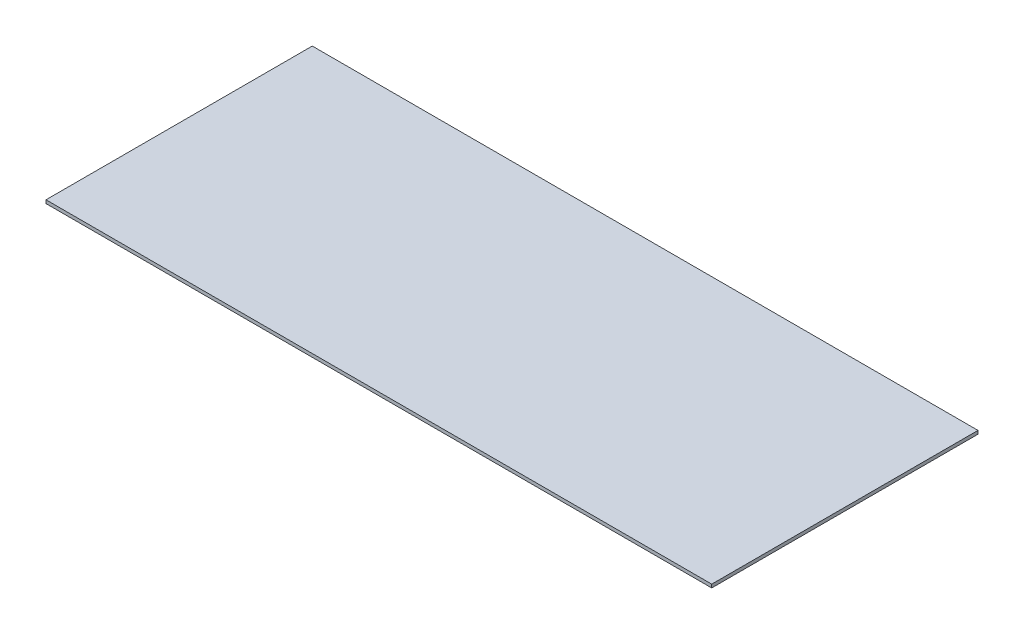
ISO-10303-21;
HEADER;
FILE_DESCRIPTION(('STEP AP214'),'2;1');
FILE_NAME('part.step','',(''),(''),'','','');
FILE_SCHEMA(('AUTOMOTIVE_DESIGN { 1 0 10303 214 1 1 1 1 }'));
ENDSEC;
DATA;
#1=APPLICATION_CONTEXT('core data for automotive mechanical design processes');
#2=APPLICATION_PROTOCOL_DEFINITION('international standard','automotive_design',2000,#1);
#3=PRODUCT_CONTEXT('',#1,'mechanical');
#4=PRODUCT('Part','Part','',(#3));
#5=PRODUCT_RELATED_PRODUCT_CATEGORY('part','',(#4));
#6=PRODUCT_DEFINITION_FORMATION('','',#4);
#7=PRODUCT_DEFINITION_CONTEXT('part definition',#1,'design');
#8=PRODUCT_DEFINITION('design','',#6,#7);
#9=PRODUCT_DEFINITION_SHAPE('','',#8);
#10=(LENGTH_UNIT() NAMED_UNIT(*) SI_UNIT(.MILLI.,.METRE.));
#11=(NAMED_UNIT(*) PLANE_ANGLE_UNIT() SI_UNIT($,.RADIAN.));
#12=(NAMED_UNIT(*) SI_UNIT($,.STERADIAN.) SOLID_ANGLE_UNIT());
#13=UNCERTAINTY_MEASURE_WITH_UNIT(LENGTH_MEASURE(1.E-05),#10,'distance_accuracy_value','');
#14=(GEOMETRIC_REPRESENTATION_CONTEXT(3) GLOBAL_UNCERTAINTY_ASSIGNED_CONTEXT((#13)) GLOBAL_UNIT_ASSIGNED_CONTEXT((#10,
#11,#12)) REPRESENTATION_CONTEXT('',''));
#15=CARTESIAN_POINT('',(0.,0.,0.));
#16=DIRECTION('',(0.,0.,1.));
#17=DIRECTION('',(1.,0.,0.));
#18=AXIS2_PLACEMENT_3D('',#15,#16,#17);
#19=CARTESIAN_POINT('',(-100.,1.,-40.));
#20=DIRECTION('',(1.,0.,0.));
#21=DIRECTION('',(0.,0.,-1.));
#22=AXIS2_PLACEMENT_3D('',#19,#20,#21);
#23=PLANE('',#22);
#24=DIRECTION('',(0.,0.,1.));
#25=VECTOR('',#24,1.);
#26=CARTESIAN_POINT('',(-100.,0.,-40.));
#27=LINE('',#26,#25);
#28=CARTESIAN_POINT('',(-100.,0.,-40.));
#29=VERTEX_POINT('',#28);
#30=CARTESIAN_POINT('',(-100.,0.,40.));
#31=VERTEX_POINT('',#30);
#32=EDGE_CURVE('E97',#29,#31,#27,.T.);
#33=ORIENTED_EDGE('',*,*,#32,.T.);
#34=DIRECTION('',(0.,-1.,0.));
#35=VECTOR('',#34,1.);
#36=CARTESIAN_POINT('',(-100.,1.,40.));
#37=LINE('',#36,#35);
#38=CARTESIAN_POINT('',(-100.,1.,40.));
#39=VERTEX_POINT('',#38);
#40=EDGE_CURVE('E11',#39,#31,#37,.T.);
#41=ORIENTED_EDGE('',*,*,#40,.F.);
#42=DIRECTION('',(0.,0.,1.));
#43=VECTOR('',#42,1.);
#44=CARTESIAN_POINT('',(-100.,1.,-40.));
#45=LINE('',#44,#43);
#46=CARTESIAN_POINT('',(-100.,1.,-40.));
#47=VERTEX_POINT('',#46);
#48=EDGE_CURVE('E85',#47,#39,#45,.T.);
#49=ORIENTED_EDGE('',*,*,#48,.F.);
#50=DIRECTION('',(0.,-1.,0.));
#51=VECTOR('',#50,1.);
#52=CARTESIAN_POINT('',(-100.,1.,-40.));
#53=LINE('',#52,#51);
#54=EDGE_CURVE('E93',#47,#29,#53,.T.);
#55=ORIENTED_EDGE('',*,*,#54,.T.);
#56=EDGE_LOOP('',(#33,#41,#49,#55));
#57=FACE_BOUND('',#56,.T.);
#58=ADVANCED_FACE('F34',(#57),#23,.F.);
#59=CARTESIAN_POINT('',(-100.,1.,40.));
#60=DIRECTION('',(0.,0.,-1.));
#61=DIRECTION('',(-1.,0.,0.));
#62=AXIS2_PLACEMENT_3D('',#59,#60,#61);
#63=PLANE('',#62);
#64=DIRECTION('',(1.,0.,0.));
#65=VECTOR('',#64,1.);
#66=CARTESIAN_POINT('',(-100.,0.,40.));
#67=LINE('',#66,#65);
#68=CARTESIAN_POINT('',(100.,0.,40.));
#69=VERTEX_POINT('',#68);
#70=EDGE_CURVE('E89',#31,#69,#67,.T.);
#71=ORIENTED_EDGE('',*,*,#70,.T.);
#72=DIRECTION('',(0.,-1.,0.));
#73=VECTOR('',#72,1.);
#74=CARTESIAN_POINT('',(100.,1.,40.));
#75=LINE('',#74,#73);
#76=CARTESIAN_POINT('',(100.,1.,40.));
#77=VERTEX_POINT('',#76);
#78=EDGE_CURVE('E42',#77,#69,#75,.T.);
#79=ORIENTED_EDGE('',*,*,#78,.F.);
#80=DIRECTION('',(1.,0.,0.));
#81=VECTOR('',#80,1.);
#82=CARTESIAN_POINT('',(-100.,1.,40.));
#83=LINE('',#82,#81);
#84=EDGE_CURVE('E80',#39,#77,#83,.T.);
#85=ORIENTED_EDGE('',*,*,#84,.F.);
#86=ORIENTED_EDGE('',*,*,#40,.T.);
#87=EDGE_LOOP('',(#71,#79,#85,#86));
#88=FACE_BOUND('',#87,.T.);
#89=ADVANCED_FACE('F88',(#88),#63,.F.);
#90=CARTESIAN_POINT('',(100.,1.,-40.));
#91=DIRECTION('',(-1.,0.,0.));
#92=DIRECTION('',(0.,0.,1.));
#93=AXIS2_PLACEMENT_3D('',#90,#91,#92);
#94=PLANE('',#93);
#95=DIRECTION('',(0.,0.,-1.));
#96=VECTOR('',#95,1.);
#97=CARTESIAN_POINT('',(100.,0.,-40.));
#98=LINE('',#97,#96);
#99=CARTESIAN_POINT('',(100.,0.,-40.));
#100=VERTEX_POINT('',#99);
#101=EDGE_CURVE('E67',#69,#100,#98,.T.);
#102=ORIENTED_EDGE('',*,*,#101,.T.);
#103=DIRECTION('',(0.,-1.,0.));
#104=VECTOR('',#103,1.);
#105=CARTESIAN_POINT('',(100.,1.,-40.));
#106=LINE('',#105,#104);
#107=CARTESIAN_POINT('',(100.,1.,-40.));
#108=VERTEX_POINT('',#107);
#109=EDGE_CURVE('E90',#108,#100,#106,.T.);
#110=ORIENTED_EDGE('',*,*,#109,.F.);
#111=DIRECTION('',(0.,0.,-1.));
#112=VECTOR('',#111,1.);
#113=CARTESIAN_POINT('',(100.,1.,-40.));
#114=LINE('',#113,#112);
#115=EDGE_CURVE('E83',#77,#108,#114,.T.);
#116=ORIENTED_EDGE('',*,*,#115,.F.);
#117=ORIENTED_EDGE('',*,*,#78,.T.);
#118=EDGE_LOOP('',(#102,#110,#116,#117));
#119=FACE_BOUND('',#118,.T.);
#120=ADVANCED_FACE('F91',(#119),#94,.F.);
#121=CARTESIAN_POINT('',(-100.,1.,-40.));
#122=DIRECTION('',(0.,0.,1.));
#123=DIRECTION('',(1.,0.,0.));
#124=AXIS2_PLACEMENT_3D('',#121,#122,#123);
#125=PLANE('',#124);
#126=DIRECTION('',(-1.,0.,0.));
#127=VECTOR('',#126,1.);
#128=CARTESIAN_POINT('',(-100.,0.,-40.));
#129=LINE('',#128,#127);
#130=EDGE_CURVE('E73',#100,#29,#129,.T.);
#131=ORIENTED_EDGE('',*,*,#130,.T.);
#132=ORIENTED_EDGE('',*,*,#54,.F.);
#133=DIRECTION('',(-1.,0.,0.));
#134=VECTOR('',#133,1.);
#135=CARTESIAN_POINT('',(-100.,1.,-40.));
#136=LINE('',#135,#134);
#137=EDGE_CURVE('E50',#108,#47,#136,.T.);
#138=ORIENTED_EDGE('',*,*,#137,.F.);
#139=ORIENTED_EDGE('',*,*,#109,.T.);
#140=EDGE_LOOP('',(#131,#132,#138,#139));
#141=FACE_BOUND('',#140,.T.);
#142=ADVANCED_FACE('F104',(#141),#125,.F.);
#143=CARTESIAN_POINT('',(0.,1.,0.));
#144=DIRECTION('',(0.,1.,0.));
#145=DIRECTION('',(0.,0.,1.));
#146=AXIS2_PLACEMENT_3D('',#143,#144,#145);
#147=PLANE('',#146);
#148=ORIENTED_EDGE('',*,*,#48,.T.);
#149=ORIENTED_EDGE('',*,*,#84,.T.);
#150=ORIENTED_EDGE('',*,*,#115,.T.);
#151=ORIENTED_EDGE('',*,*,#137,.T.);
#152=EDGE_LOOP('',(#148,#149,#150,#151));
#153=FACE_BOUND('',#152,.T.);
#154=ADVANCED_FACE('F81',(#153),#147,.T.);
#155=CARTESIAN_POINT('',(0.,0.,0.));
#156=DIRECTION('',(0.,1.,0.));
#157=DIRECTION('',(0.,0.,1.));
#158=AXIS2_PLACEMENT_3D('',#155,#156,#157);
#159=PLANE('',#158);
#160=ORIENTED_EDGE('',*,*,#32,.F.);
#161=ORIENTED_EDGE('',*,*,#130,.F.);
#162=ORIENTED_EDGE('',*,*,#101,.F.);
#163=ORIENTED_EDGE('',*,*,#70,.F.);
#164=EDGE_LOOP('',(#160,#161,#162,#163));
#165=FACE_BOUND('',#164,.T.);
#166=ADVANCED_FACE('F107',(#165),#159,.F.);
#167=CLOSED_SHELL('',(#58,#89,#120,#142,#154,#166));
#168=MANIFOLD_SOLID_BREP('B2',#167);
#169=ADVANCED_BREP_SHAPE_REPRESENTATION('',(#18,#168),#14);
#170=SHAPE_DEFINITION_REPRESENTATION(#9,#169);
ENDSEC;
END-ISO-10303-21;
